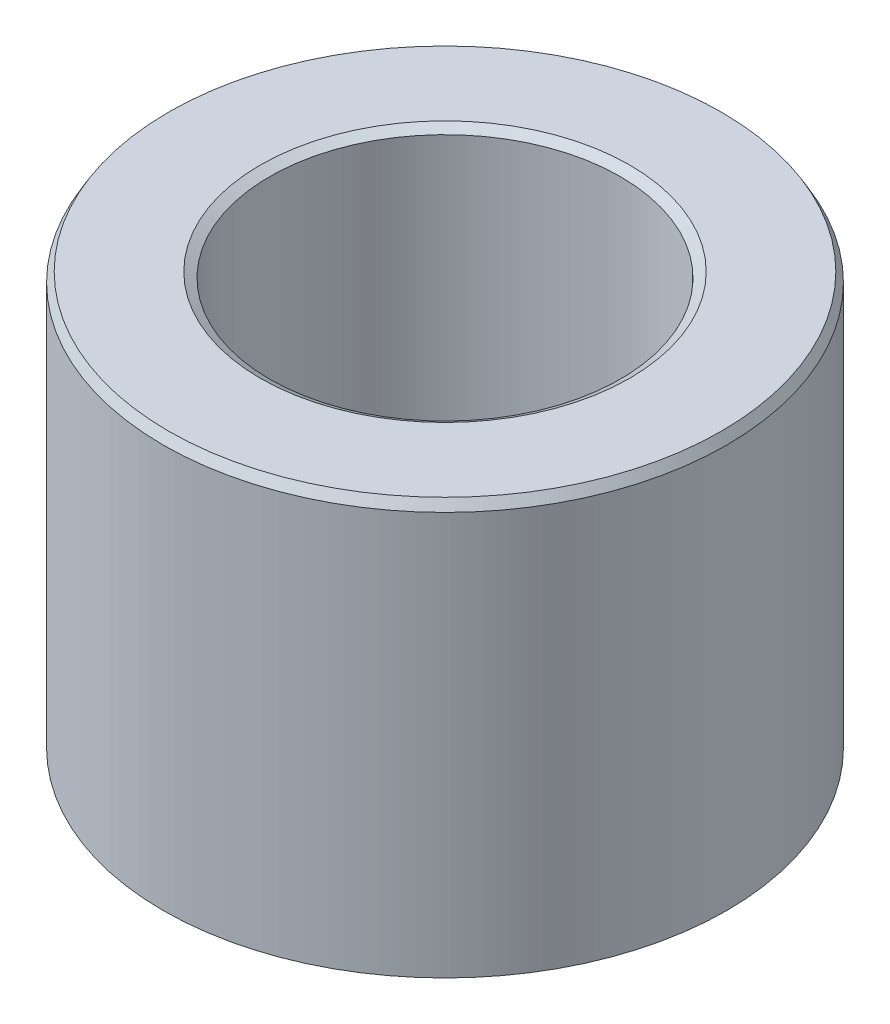
ISO-10303-21;
HEADER;
FILE_DESCRIPTION(('STEP AP214'),'2;1');
FILE_NAME('part.step','',(''),(''),'','','');
FILE_SCHEMA(('AUTOMOTIVE_DESIGN { 1 0 10303 214 1 1 1 1 }'));
ENDSEC;
DATA;
#1=APPLICATION_CONTEXT('core data for automotive mechanical design processes');
#2=APPLICATION_PROTOCOL_DEFINITION('international standard','automotive_design',2000,#1);
#3=PRODUCT_CONTEXT('',#1,'mechanical');
#4=PRODUCT('Part','Part','',(#3));
#5=PRODUCT_RELATED_PRODUCT_CATEGORY('part','',(#4));
#6=PRODUCT_DEFINITION_FORMATION('','',#4);
#7=PRODUCT_DEFINITION_CONTEXT('part definition',#1,'design');
#8=PRODUCT_DEFINITION('design','',#6,#7);
#9=PRODUCT_DEFINITION_SHAPE('','',#8);
#10=(LENGTH_UNIT() NAMED_UNIT(*) SI_UNIT(.MILLI.,.METRE.));
#11=(NAMED_UNIT(*) PLANE_ANGLE_UNIT() SI_UNIT($,.RADIAN.));
#12=(NAMED_UNIT(*) SI_UNIT($,.STERADIAN.) SOLID_ANGLE_UNIT());
#13=UNCERTAINTY_MEASURE_WITH_UNIT(LENGTH_MEASURE(1.E-05),#10,'distance_accuracy_value','');
#14=(GEOMETRIC_REPRESENTATION_CONTEXT(3) GLOBAL_UNCERTAINTY_ASSIGNED_CONTEXT((#13)) GLOBAL_UNIT_ASSIGNED_CONTEXT((#10,
#11,#12)) REPRESENTATION_CONTEXT('',''));
#15=CARTESIAN_POINT('',(0.,0.,0.));
#16=DIRECTION('',(0.,0.,1.));
#17=DIRECTION('',(1.,0.,0.));
#18=AXIS2_PLACEMENT_3D('',#15,#16,#17);
#19=CARTESIAN_POINT('',(0.,70.4505169168526,0.));
#20=DIRECTION('',(0.,-1.,0.));
#21=DIRECTION('',(0.,0.,-1.));
#22=AXIS2_PLACEMENT_3D('',#19,#20,#21);
#23=CYLINDRICAL_SURFACE('',#22,47.5);
#24=CARTESIAN_POINT('',(0.,0.906857300758568,0.));
#25=DIRECTION('',(0.,1.,0.));
#26=DIRECTION('',(0.,0.,1.));
#27=AXIS2_PLACEMENT_3D('',#24,#25,#26);
#28=CIRCLE('',#27,47.5);
#29=CARTESIAN_POINT('',(0.,0.906857300758568,47.5));
#30=VERTEX_POINT('',#29);
#31=EDGE_CURVE('E10',#30,#30,#28,.T.);
#32=ORIENTED_EDGE('',*,*,#31,.T.);
#33=EDGE_LOOP('',(#32));
#34=FACE_BOUND('',#33,.T.);
#35=CARTESIAN_POINT('',(0.,68.8797939967239,0.));
#36=DIRECTION('',(0.,1.,0.));
#37=DIRECTION('',(0.,0.,1.));
#38=AXIS2_PLACEMENT_3D('',#35,#36,#37);
#39=CIRCLE('',#38,47.5);
#40=CARTESIAN_POINT('',(0.,68.8797939967239,-47.5));
#41=VERTEX_POINT('',#40);
#42=EDGE_CURVE('E50',#41,#41,#39,.F.);
#43=ORIENTED_EDGE('',*,*,#42,.T.);
#44=EDGE_LOOP('',(#43));
#45=FACE_BOUND('',#44,.T.);
#46=ADVANCED_FACE('F39',(#34,#45),#23,.T.);
#47=CARTESIAN_POINT('',(0.,70.4505169168526,0.));
#48=DIRECTION('',(0.,1.,0.));
#49=DIRECTION('',(0.,0.,1.));
#50=AXIS2_PLACEMENT_3D('',#47,#48,#49);
#51=PLANE('',#50);
#52=CARTESIAN_POINT('',(0.,70.4505169168526,0.));
#53=DIRECTION('',(0.,1.,0.));
#54=DIRECTION('',(0.,0.,1.));
#55=AXIS2_PLACEMENT_3D('',#52,#53,#54);
#56=CIRCLE('',#55,31.1421706598731);
#57=CARTESIAN_POINT('',(0.,70.4505169168526,31.1421706598731));
#58=VERTEX_POINT('',#57);
#59=EDGE_CURVE('E58',#58,#58,#56,.F.);
#60=ORIENTED_EDGE('',*,*,#59,.T.);
#61=EDGE_LOOP('',(#60));
#62=FACE_BOUND('',#61,.T.);
#63=CARTESIAN_POINT('',(0.,70.4505169168526,0.));
#64=DIRECTION('',(0.,1.,0.));
#65=DIRECTION('',(0.,0.,1.));
#66=AXIS2_PLACEMENT_3D('',#63,#64,#65);
#67=CIRCLE('',#66,46.5931426992414);
#68=CARTESIAN_POINT('',(0.,70.4505169168526,-46.5931426992414));
#69=VERTEX_POINT('',#68);
#70=EDGE_CURVE('E61',#69,#69,#67,.T.);
#71=ORIENTED_EDGE('',*,*,#70,.T.);
#72=EDGE_LOOP('',(#71));
#73=FACE_BOUND('',#72,.T.);
#74=ADVANCED_FACE('F88',(#62,#73),#51,.T.);
#75=CARTESIAN_POINT('',(0.,0.,0.));
#76=DIRECTION('',(0.,1.,0.));
#77=DIRECTION('',(0.,0.,1.));
#78=AXIS2_PLACEMENT_3D('',#75,#76,#77);
#79=PLANE('',#78);
#80=CARTESIAN_POINT('',(0.,0.,0.));
#81=DIRECTION('',(0.,1.,0.));
#82=DIRECTION('',(0.,0.,1.));
#83=AXIS2_PLACEMENT_3D('',#80,#81,#82);
#84=CIRCLE('',#83,30.478305040503);
#85=CARTESIAN_POINT('',(0.,0.,30.478305040503));
#86=VERTEX_POINT('',#85);
#87=EDGE_CURVE('E51',#86,#86,#84,.T.);
#88=ORIENTED_EDGE('',*,*,#87,.T.);
#89=EDGE_LOOP('',(#88));
#90=FACE_BOUND('',#89,.T.);
#91=CARTESIAN_POINT('',(0.,0.,0.));
#92=DIRECTION('',(0.,1.,0.));
#93=DIRECTION('',(0.,0.,1.));
#94=AXIS2_PLACEMENT_3D('',#91,#92,#93);
#95=CIRCLE('',#94,45.9292770798714);
#96=CARTESIAN_POINT('',(0.,0.,45.9292770798714));
#97=VERTEX_POINT('',#96);
#98=EDGE_CURVE('E54',#97,#97,#95,.F.);
#99=ORIENTED_EDGE('',*,*,#98,.T.);
#100=EDGE_LOOP('',(#99));
#101=FACE_BOUND('',#100,.T.);
#102=ADVANCED_FACE('F83',(#90,#101),#79,.F.);
#103=CARTESIAN_POINT('',(0.,70.4505169168526,0.));
#104=DIRECTION('',(0.,-1.,0.));
#105=DIRECTION('',(0.,0.,-1.));
#106=AXIS2_PLACEMENT_3D('',#103,#104,#105);
#107=CYLINDRICAL_SURFACE('',#106,29.5714477397445);
#108=CARTESIAN_POINT('',(0.,69.543659616094,0.));
#109=DIRECTION('',(0.,1.,0.));
#110=DIRECTION('',(0.,0.,1.));
#111=AXIS2_PLACEMENT_3D('',#108,#109,#110);
#112=CIRCLE('',#111,29.5714477397445);
#113=CARTESIAN_POINT('',(0.,69.543659616094,29.5714477397445));
#114=VERTEX_POINT('',#113);
#115=EDGE_CURVE('E67',#114,#114,#112,.T.);
#116=ORIENTED_EDGE('',*,*,#115,.T.);
#117=EDGE_LOOP('',(#116));
#118=FACE_BOUND('',#117,.T.);
#119=CARTESIAN_POINT('',(0.,1.57072292012857,0.));
#120=DIRECTION('',(0.,1.,0.));
#121=DIRECTION('',(0.,0.,1.));
#122=AXIS2_PLACEMENT_3D('',#119,#120,#121);
#123=CIRCLE('',#122,29.5714477397445);
#124=CARTESIAN_POINT('',(0.,1.57072292012857,29.5714477397445));
#125=VERTEX_POINT('',#124);
#126=EDGE_CURVE('E69',#125,#125,#123,.F.);
#127=ORIENTED_EDGE('',*,*,#126,.T.);
#128=EDGE_LOOP('',(#127));
#129=FACE_BOUND('',#128,.T.);
#130=ADVANCED_FACE('F71',(#118,#129),#107,.F.);
#131=CARTESIAN_POINT('',(0.,69.543659616094,0.));
#132=DIRECTION('',(0.,1.,0.));
#133=DIRECTION('',(0.,0.,1.));
#134=AXIS2_PLACEMENT_3D('',#131,#132,#133);
#135=CONICAL_SURFACE('',#134,29.5714477397445,1.0471975511966);
#136=CARTESIAN_POINT('',(0.,70.4505169168526,31.1421706598731));
#137=CARTESIAN_POINT('',(0.,70.4410704866363,31.1258089627884));
#138=CARTESIAN_POINT('',(0.,70.4316240564201,31.1094472657038));
#139=CARTESIAN_POINT('',(0.,70.4127311959876,31.0767238715344));
#140=CARTESIAN_POINT('',(0.,70.4032847657714,31.0603621744497));
#141=CARTESIAN_POINT('',(0.,70.3843919053389,31.0276387802804));
#142=CARTESIAN_POINT('',(0.,70.3749454751227,31.0112770831957));
#143=CARTESIAN_POINT('',(0.,70.3560526146902,30.9785536890264));
#144=CARTESIAN_POINT('',(0.,70.346606184474,30.9621919919417));
#145=CARTESIAN_POINT('',(0.,70.3277133240415,30.9294685977724));
#146=CARTESIAN_POINT('',(0.,70.3182668938253,30.9131069006877));
#147=CARTESIAN_POINT('',(0.,70.2993740333928,30.8803835065183));
#148=CARTESIAN_POINT('',(0.,70.2899276031766,30.8640218094337));
#149=CARTESIAN_POINT('',(0.,70.2710347427441,30.8312984152643));
#150=CARTESIAN_POINT('',(0.,70.2615883125279,30.8149367181796));
#151=CARTESIAN_POINT('',(0.,70.2426954520954,30.7822133240103));
#152=CARTESIAN_POINT('',(0.,70.2332490218791,30.7658516269256));
#153=CARTESIAN_POINT('',(0.,70.2143561614467,30.7331282327563));
#154=CARTESIAN_POINT('',(0.,70.2049097312304,30.7167665356716));
#155=CARTESIAN_POINT('',(0.,70.186016870798,30.6840431415023));
#156=CARTESIAN_POINT('',(0.,70.1765704405817,30.6676814444176));
#157=CARTESIAN_POINT('',(0.,70.1576775801493,30.6349580502482));
#158=CARTESIAN_POINT('',(0.,70.148231149933,30.6185963531636));
#159=CARTESIAN_POINT('',(0.,70.1293382895006,30.5858729589942));
#160=CARTESIAN_POINT('',(0.,70.1198918592843,30.5695112619096));
#161=CARTESIAN_POINT('',(0.,70.1009989988519,30.5367878677402));
#162=CARTESIAN_POINT('',(0.,70.0915525686356,30.5204261706555));
#163=CARTESIAN_POINT('',(0.,70.0726597082032,30.4877027764862));
#164=CARTESIAN_POINT('',(0.,70.0632132779869,30.4713410794015));
#165=CARTESIAN_POINT('',(0.,70.0443204175545,30.4386176852322));
#166=CARTESIAN_POINT('',(0.,70.0348739873382,30.4222559881475));
#167=CARTESIAN_POINT('',(0.,70.0159811269057,30.3895325939781));
#168=CARTESIAN_POINT('',(0.,70.0065346966895,30.3731708968935));
#169=CARTESIAN_POINT('',(0.,69.987641836257,30.3404475027241));
#170=CARTESIAN_POINT('',(0.,69.9781954060408,30.3240858056395));
#171=CARTESIAN_POINT('',(0.,69.9593025456083,30.2913624114701));
#172=CARTESIAN_POINT('',(0.,69.9498561153921,30.2750007143854));
#173=CARTESIAN_POINT('',(0.,69.9309632549596,30.2422773202161));
#174=CARTESIAN_POINT('',(0.,69.9215168247434,30.2259156231314));
#175=CARTESIAN_POINT('',(0.,69.9026239643109,30.1931922289621));
#176=CARTESIAN_POINT('',(0.,69.8931775340947,30.1768305318774));
#177=CARTESIAN_POINT('',(0.,69.8742846736622,30.144107137708));
#178=CARTESIAN_POINT('',(0.,69.864838243446,30.1277454406234));
#179=CARTESIAN_POINT('',(0.,69.8459453830135,30.095022046454));
#180=CARTESIAN_POINT('',(0.,69.8364989527973,30.0786603493694));
#181=CARTESIAN_POINT('',(0.,69.8176060923648,30.0459369552));
#182=CARTESIAN_POINT('',(0.,69.8081596621486,30.0295752581153));
#183=CARTESIAN_POINT('',(0.,69.7892668017161,29.996851863946));
#184=CARTESIAN_POINT('',(0.,69.7798203714999,29.9804901668613));
#185=CARTESIAN_POINT('',(0.,69.7609275110674,29.947766772692));
#186=CARTESIAN_POINT('',(0.,69.7514810808511,29.9314050756073));
#187=CARTESIAN_POINT('',(0.,69.7325882204187,29.8986816814379));
#188=CARTESIAN_POINT('',(0.,69.7231417902024,29.8823199843533));
#189=CARTESIAN_POINT('',(0.,69.70424892977,29.8495965901839));
#190=CARTESIAN_POINT('',(0.,69.6948024995537,29.8332348930993));
#191=CARTESIAN_POINT('',(0.,69.6759096391213,29.8005114989299));
#192=CARTESIAN_POINT('',(0.,69.666463208905,29.7841498018452));
#193=CARTESIAN_POINT('',(0.,69.6475703484726,29.7514264076759));
#194=CARTESIAN_POINT('',(0.,69.6381239182563,29.7350647105912));
#195=CARTESIAN_POINT('',(0.,69.6192310578239,29.7023413164219));
#196=CARTESIAN_POINT('',(0.,69.6097846276076,29.6859796193372));
#197=CARTESIAN_POINT('',(0.,69.5908917671752,29.6532562251679));
#198=CARTESIAN_POINT('',(0.,69.5814453369589,29.6368945280832));
#199=CARTESIAN_POINT('',(0.,69.5625524765265,29.6041711339138));
#200=CARTESIAN_POINT('',(0.,69.5531060463102,29.5878094368292));
#201=CARTESIAN_POINT('',(0.,69.543659616094,29.5714477397445));
#202=B_SPLINE_CURVE_WITH_KNOTS('',3,(#136,#137,#138,#139,#140,#141,#142,#143,#144,#145,#146,
#147,#148,#149,#150,#151,#152,#153,#154,#155,#156,#157,#158,#159,#160,#161,#162,#163,#164,#165,
#166,#167,#168,#169,#170,#171,#172,#173,#174,#175,#176,#177,#178,#179,#180,#181,#182,#183,#184,
#185,#186,#187,#188,#189,#190,#191,#192,#193,#194,#195,#196,#197,#198,#199,#200,#201),
.UNSPECIFIED.,.F.,.F.,(4,2,2,2,2,2,2,2,2,2,2,2,2,2,2,2,2,2,2,2,2,2,2,2,2,2,2,2,2,2,2,2,4),(0.,
0.0566785812974157,0.113357162594827,0.170035743892236,0.226714325189652,0.283392906487061,
0.340071487784469,0.396750069081878,0.453428650379297,0.510107231676705,0.566785812974114,
0.62346439427153,0.680142975568939,0.736821556866347,0.793500138163759,0.850178719461175,
0.906857300758584,0.963535882055992,1.02021446335341,1.07689304465082,1.13357162594823,
1.19025020724564,1.24692878854305,1.30360736984046,1.36028595113787,1.41696453243529,
1.4736431137327,1.53032169503011,1.58700027632752,1.64367885762493,1.70035743892234,
1.75703602021975,1.81371460151716),.UNSPECIFIED.);
#203=EDGE_CURVE('BSEAM77',#58,#114,#202,.T.);
#204=ORIENTED_EDGE('',*,*,#59,.F.);
#205=ORIENTED_EDGE('',*,*,#115,.F.);
#206=ORIENTED_EDGE('',*,*,#203,.T.);
#207=ORIENTED_EDGE('',*,*,#203,.F.);
#208=EDGE_LOOP('',(#204,#206,#205,#207));
#209=FACE_BOUND('',#208,.T.);
#210=ADVANCED_FACE('F77',(#209),#135,.F.);
#211=CARTESIAN_POINT('',(0.,0.,0.));
#212=DIRECTION('',(0.,-1.,0.));
#213=DIRECTION('',(0.,0.,-1.));
#214=AXIS2_PLACEMENT_3D('',#211,#212,#213);
#215=CONICAL_SURFACE('',#214,30.478305040503,0.523598775598292);
#216=ORIENTED_EDGE('',*,*,#126,.F.);
#217=EDGE_LOOP('',(#216));
#218=FACE_BOUND('',#217,.T.);
#219=ORIENTED_EDGE('',*,*,#87,.F.);
#220=EDGE_LOOP('',(#219));
#221=FACE_BOUND('',#220,.T.);
#222=ADVANCED_FACE('F73',(#218,#221),#215,.F.);
#223=CARTESIAN_POINT('',(0.,0.906857300758568,0.));
#224=DIRECTION('',(0.,1.,0.));
#225=DIRECTION('',(0.,0.,1.));
#226=AXIS2_PLACEMENT_3D('',#223,#224,#225);
#227=CONICAL_SURFACE('',#226,47.5,1.0471975511966);
#228=ORIENTED_EDGE('',*,*,#98,.F.);
#229=EDGE_LOOP('',(#228));
#230=FACE_BOUND('',#229,.T.);
#231=ORIENTED_EDGE('',*,*,#31,.F.);
#232=EDGE_LOOP('',(#231));
#233=FACE_BOUND('',#232,.T.);
#234=ADVANCED_FACE('F76',(#230,#233),#227,.T.);
#235=CARTESIAN_POINT('',(0.,70.4505169168526,0.));
#236=DIRECTION('',(0.,-1.,0.));
#237=DIRECTION('',(0.,0.,-1.));
#238=AXIS2_PLACEMENT_3D('',#235,#236,#237);
#239=CONICAL_SURFACE('',#238,46.5931426992414,0.523598775598294);
#240=CARTESIAN_POINT('',(0.,68.8797939967239,-47.5));
#241=CARTESIAN_POINT('',(0.,68.8961556938086,-47.4905535697838));
#242=CARTESIAN_POINT('',(0.,68.9125173908932,-47.4811071395675));
#243=CARTESIAN_POINT('',(0.,68.9452407850626,-47.4622142791351));
#244=CARTESIAN_POINT('',(0.,68.9616024821473,-47.4527678489188));
#245=CARTESIAN_POINT('',(0.,68.9943258763166,-47.4338749884864));
#246=CARTESIAN_POINT('',(0.,69.0106875734013,-47.4244285582701));
#247=CARTESIAN_POINT('',(0.,69.0434109675706,-47.4055356978377));
#248=CARTESIAN_POINT('',(0.,69.0597726646553,-47.3960892676214));
#249=CARTESIAN_POINT('',(0.,69.0924960588247,-47.377196407189));
#250=CARTESIAN_POINT('',(0.,69.1088577559093,-47.3677499769727));
#251=CARTESIAN_POINT('',(0.,69.1415811500787,-47.3488571165403));
#252=CARTESIAN_POINT('',(0.,69.1579428471634,-47.339410686324));
#253=CARTESIAN_POINT('',(0.,69.1906662413327,-47.3205178258915));
#254=CARTESIAN_POINT('',(0.,69.2070279384174,-47.3110713956753));
#255=CARTESIAN_POINT('',(0.,69.2397513325867,-47.2921785352428));
#256=CARTESIAN_POINT('',(0.,69.2561130296714,-47.2827321050266));
#257=CARTESIAN_POINT('',(0.,69.2888364238407,-47.2638392445941));
#258=CARTESIAN_POINT('',(0.,69.3051981209254,-47.2543928143779));
#259=CARTESIAN_POINT('',(0.,69.3379215150947,-47.2354999539454));
#260=CARTESIAN_POINT('',(0.,69.3542832121794,-47.2260535237292));
#261=CARTESIAN_POINT('',(0.,69.3870066063488,-47.2071606632967));
#262=CARTESIAN_POINT('',(0.,69.4033683034335,-47.1977142330805));
#263=CARTESIAN_POINT('',(0.,69.4360916976028,-47.178821372648));
#264=CARTESIAN_POINT('',(0.,69.4524533946875,-47.1693749424318));
#265=CARTESIAN_POINT('',(0.,69.4851767888568,-47.1504820819993));
#266=CARTESIAN_POINT('',(0.,69.5015384859415,-47.1410356517831));
#267=CARTESIAN_POINT('',(0.,69.5342618801108,-47.1221427913506));
#268=CARTESIAN_POINT('',(0.,69.5506235771955,-47.1126963611344));
#269=CARTESIAN_POINT('',(0.,69.5833469713649,-47.0938035007019));
#270=CARTESIAN_POINT('',(0.,69.5997086684495,-47.0843570704857));
#271=CARTESIAN_POINT('',(0.,69.6324320626189,-47.0654642100532));
#272=CARTESIAN_POINT('',(0.,69.6487937597036,-47.056017779837));
#273=CARTESIAN_POINT('',(0.,69.6815171538729,-47.0371249194045));
#274=CARTESIAN_POINT('',(0.,69.6978788509576,-47.0276784891882));
#275=CARTESIAN_POINT('',(0.,69.7306022451269,-47.0087856287558));
#276=CARTESIAN_POINT('',(0.,69.7469639422116,-46.9993391985395));
#277=CARTESIAN_POINT('',(0.,69.7796873363809,-46.9804463381071));
#278=CARTESIAN_POINT('',(0.,69.7960490334656,-46.9709999078908));
#279=CARTESIAN_POINT('',(0.,69.828772427635,-46.9521070474584));
#280=CARTESIAN_POINT('',(0.,69.8451341247196,-46.9426606172421));
#281=CARTESIAN_POINT('',(0.,69.877857518889,-46.9237677568097));
#282=CARTESIAN_POINT('',(0.,69.8942192159737,-46.9143213265934));
#283=CARTESIAN_POINT('',(0.,69.926942610143,-46.895428466161));
#284=CARTESIAN_POINT('',(0.,69.9433043072277,-46.8859820359447));
#285=CARTESIAN_POINT('',(0.,69.976027701397,-46.8670891755122));
#286=CARTESIAN_POINT('',(0.,69.9923893984817,-46.857642745296));
#287=CARTESIAN_POINT('',(0.,70.0251127926511,-46.8387498848635));
#288=CARTESIAN_POINT('',(0.,70.0414744897357,-46.8293034546473));
#289=CARTESIAN_POINT('',(0.,70.0741978839051,-46.8104105942148));
#290=CARTESIAN_POINT('',(0.,70.0905595809897,-46.8009641639986));
#291=CARTESIAN_POINT('',(0.,70.1232829751591,-46.7820713035661));
#292=CARTESIAN_POINT('',(0.,70.1396446722438,-46.7726248733499));
#293=CARTESIAN_POINT('',(0.,70.1723680664131,-46.7537320129174));
#294=CARTESIAN_POINT('',(0.,70.1887297634978,-46.7442855827012));
#295=CARTESIAN_POINT('',(0.,70.2214531576671,-46.7253927222687));
#296=CARTESIAN_POINT('',(0.,70.2378148547518,-46.7159462920525));
#297=CARTESIAN_POINT('',(0.,70.2705382489212,-46.69705343162));
#298=CARTESIAN_POINT('',(0.,70.2868999460058,-46.6876070014038));
#299=CARTESIAN_POINT('',(0.,70.3196233401752,-46.6687141409713));
#300=CARTESIAN_POINT('',(0.,70.3359850372598,-46.6592677107551));
#301=CARTESIAN_POINT('',(0.,70.3687084314292,-46.6403748503226));
#302=CARTESIAN_POINT('',(0.,70.3850701285139,-46.6309284201064));
#303=CARTESIAN_POINT('',(0.,70.4177935226832,-46.6120355596739));
#304=CARTESIAN_POINT('',(0.,70.4341552197679,-46.6025891294577));
#305=CARTESIAN_POINT('',(0.,70.4505169168526,-46.5931426992414));
#306=B_SPLINE_CURVE_WITH_KNOTS('',3,(#240,#241,#242,#243,#244,#245,#246,#247,#248,#249,#250,
#251,#252,#253,#254,#255,#256,#257,#258,#259,#260,#261,#262,#263,#264,#265,#266,#267,#268,#269,
#270,#271,#272,#273,#274,#275,#276,#277,#278,#279,#280,#281,#282,#283,#284,#285,#286,#287,#288,
#289,#290,#291,#292,#293,#294,#295,#296,#297,#298,#299,#300,#301,#302,#303,#304,#305),
.UNSPECIFIED.,.F.,.F.,(4,2,2,2,2,2,2,2,2,2,2,2,2,2,2,2,2,2,2,2,2,2,2,2,2,2,2,2,2,2,2,2,4),(0.,
0.0566785812974032,0.113357162594818,0.17003574389223,0.226714325189645,0.283392906487057,
0.340071487784472,0.396750069081887,0.453428650379299,0.510107231676702,0.566785812974114,
0.623464394271529,0.680142975568945,0.736821556866356,0.793500138163772,0.850178719461183,
0.906857300758598,0.963535882056001,1.02021446335341,1.07689304465083,1.13357162594824,
1.19025020724566,1.24692878854307,1.30360736984048,1.3602859511379,1.4169645324353,
1.47364311373271,1.53032169503012,1.58700027632754,1.64367885762496,1.70035743892237,
1.75703602021978,1.81371460151719),.UNSPECIFIED.);
#307=EDGE_CURVE('BSEAM45',#41,#69,#306,.T.);
#308=ORIENTED_EDGE('',*,*,#42,.F.);
#309=ORIENTED_EDGE('',*,*,#70,.F.);
#310=ORIENTED_EDGE('',*,*,#307,.T.);
#311=ORIENTED_EDGE('',*,*,#307,.F.);
#312=EDGE_LOOP('',(#308,#310,#309,#311));
#313=FACE_BOUND('',#312,.T.);
#314=ADVANCED_FACE('F45',(#313),#239,.T.);
#315=CLOSED_SHELL('',(#46,#74,#102,#130,#210,#222,#234,#314));
#316=MANIFOLD_SOLID_BREP('B2',#315);
#317=ADVANCED_BREP_SHAPE_REPRESENTATION('',(#18,#316),#14);
#318=SHAPE_DEFINITION_REPRESENTATION(#9,#317);
ENDSEC;
END-ISO-10303-21;
